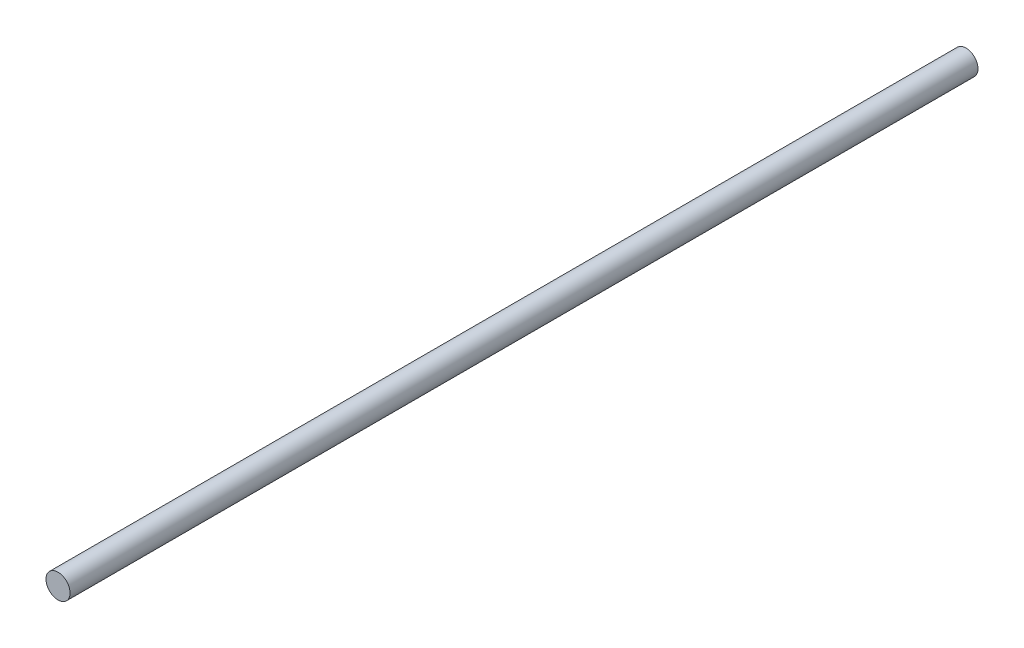
ISO-10303-21;
HEADER;
FILE_DESCRIPTION(('STEP AP214'),'2;1');
FILE_NAME('part.step','',(''),(''),'','','');
FILE_SCHEMA(('AUTOMOTIVE_DESIGN { 1 0 10303 214 1 1 1 1 }'));
ENDSEC;
DATA;
#1=APPLICATION_CONTEXT('core data for automotive mechanical design processes');
#2=APPLICATION_PROTOCOL_DEFINITION('international standard','automotive_design',2000,#1);
#3=PRODUCT_CONTEXT('',#1,'mechanical');
#4=PRODUCT('Part','Part','',(#3));
#5=PRODUCT_RELATED_PRODUCT_CATEGORY('part','',(#4));
#6=PRODUCT_DEFINITION_FORMATION('','',#4);
#7=PRODUCT_DEFINITION_CONTEXT('part definition',#1,'design');
#8=PRODUCT_DEFINITION('design','',#6,#7);
#9=PRODUCT_DEFINITION_SHAPE('','',#8);
#10=(LENGTH_UNIT() NAMED_UNIT(*) SI_UNIT(.MILLI.,.METRE.));
#11=(NAMED_UNIT(*) PLANE_ANGLE_UNIT() SI_UNIT($,.RADIAN.));
#12=(NAMED_UNIT(*) SI_UNIT($,.STERADIAN.) SOLID_ANGLE_UNIT());
#13=UNCERTAINTY_MEASURE_WITH_UNIT(LENGTH_MEASURE(1.E-05),#10,'distance_accuracy_value','');
#14=(GEOMETRIC_REPRESENTATION_CONTEXT(3) GLOBAL_UNCERTAINTY_ASSIGNED_CONTEXT((#13)) GLOBAL_UNIT_ASSIGNED_CONTEXT((#10,
#11,#12)) REPRESENTATION_CONTEXT('',''));
#15=CARTESIAN_POINT('',(0.,0.,0.));
#16=DIRECTION('',(0.,0.,1.));
#17=DIRECTION('',(1.,0.,0.));
#18=AXIS2_PLACEMENT_3D('',#15,#16,#17);
#19=CARTESIAN_POINT('',(0.,0.,24.5));
#20=DIRECTION('',(0.,0.,-1.));
#21=DIRECTION('',(-1.,0.,0.));
#22=AXIS2_PLACEMENT_3D('',#19,#20,#21);
#23=CYLINDRICAL_SURFACE('',#22,0.325);
#24=CARTESIAN_POINT('',(0.,0.,24.5));
#25=DIRECTION('',(0.,0.,1.));
#26=DIRECTION('',(1.,0.,0.));
#27=AXIS2_PLACEMENT_3D('',#24,#25,#26);
#28=CIRCLE('',#27,0.325);
#29=CARTESIAN_POINT('',(0.325,0.,24.5));
#30=VERTEX_POINT('',#29);
#31=EDGE_CURVE('E10',#30,#30,#28,.T.);
#32=ORIENTED_EDGE('',*,*,#31,.F.);
#33=EDGE_LOOP('',(#32));
#34=FACE_BOUND('',#33,.T.);
#35=CARTESIAN_POINT('',(0.,0.,0.));
#36=DIRECTION('',(0.,0.,1.));
#37=DIRECTION('',(1.,0.,0.));
#38=AXIS2_PLACEMENT_3D('',#35,#36,#37);
#39=CIRCLE('',#38,0.325);
#40=CARTESIAN_POINT('',(0.325,0.,0.));
#41=VERTEX_POINT('',#40);
#42=EDGE_CURVE('E40',#41,#41,#39,.T.);
#43=ORIENTED_EDGE('',*,*,#42,.T.);
#44=EDGE_LOOP('',(#43));
#45=FACE_BOUND('',#44,.T.);
#46=ADVANCED_FACE('F37',(#34,#45),#23,.T.);
#47=CARTESIAN_POINT('',(0.,0.,24.5));
#48=DIRECTION('',(0.,0.,1.));
#49=DIRECTION('',(1.,0.,0.));
#50=AXIS2_PLACEMENT_3D('',#47,#48,#49);
#51=PLANE('',#50);
#52=ORIENTED_EDGE('',*,*,#31,.T.);
#53=EDGE_LOOP('',(#52));
#54=FACE_BOUND('',#53,.T.);
#55=ADVANCED_FACE('F54',(#54),#51,.T.);
#56=CARTESIAN_POINT('',(0.,0.,0.));
#57=DIRECTION('',(0.,0.,1.));
#58=DIRECTION('',(1.,0.,0.));
#59=AXIS2_PLACEMENT_3D('',#56,#57,#58);
#60=PLANE('',#59);
#61=ORIENTED_EDGE('',*,*,#42,.F.);
#62=EDGE_LOOP('',(#61));
#63=FACE_BOUND('',#62,.T.);
#64=ADVANCED_FACE('F52',(#63),#60,.F.);
#65=CLOSED_SHELL('',(#46,#55,#64));
#66=MANIFOLD_SOLID_BREP('B2',#65);
#67=ADVANCED_BREP_SHAPE_REPRESENTATION('',(#18,#66),#14);
#68=SHAPE_DEFINITION_REPRESENTATION(#9,#67);
ENDSEC;
END-ISO-10303-21;
